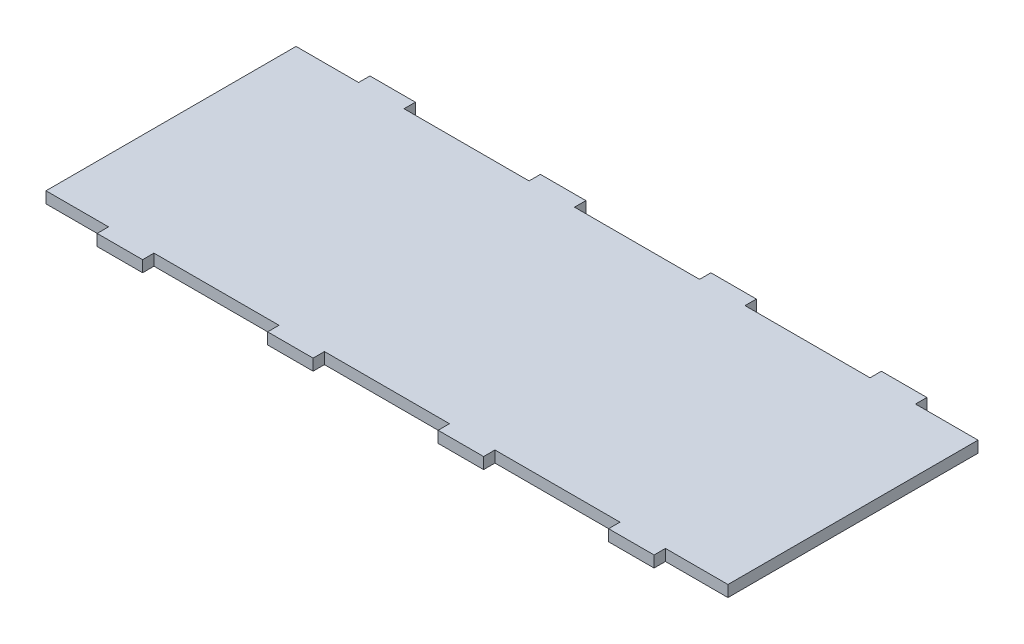
ISO-10303-21;
HEADER;
FILE_DESCRIPTION(('STEP AP214'),'2;1');
FILE_NAME('part.step','',(''),(''),'','','');
FILE_SCHEMA(('AUTOMOTIVE_DESIGN { 1 0 10303 214 1 1 1 1 }'));
ENDSEC;
DATA;
#1=APPLICATION_CONTEXT('core data for automotive mechanical design processes');
#2=APPLICATION_PROTOCOL_DEFINITION('international standard','automotive_design',2000,#1);
#3=PRODUCT_CONTEXT('',#1,'mechanical');
#4=PRODUCT('Part','Part','',(#3));
#5=PRODUCT_RELATED_PRODUCT_CATEGORY('part','',(#4));
#6=PRODUCT_DEFINITION_FORMATION('','',#4);
#7=PRODUCT_DEFINITION_CONTEXT('part definition',#1,'design');
#8=PRODUCT_DEFINITION('design','',#6,#7);
#9=PRODUCT_DEFINITION_SHAPE('','',#8);
#10=(LENGTH_UNIT() NAMED_UNIT(*) SI_UNIT(.MILLI.,.METRE.));
#11=(NAMED_UNIT(*) PLANE_ANGLE_UNIT() SI_UNIT($,.RADIAN.));
#12=(NAMED_UNIT(*) SI_UNIT($,.STERADIAN.) SOLID_ANGLE_UNIT());
#13=UNCERTAINTY_MEASURE_WITH_UNIT(LENGTH_MEASURE(1.E-05),#10,'distance_accuracy_value','');
#14=(GEOMETRIC_REPRESENTATION_CONTEXT(3) GLOBAL_UNCERTAINTY_ASSIGNED_CONTEXT((#13)) GLOBAL_UNIT_ASSIGNED_CONTEXT((#10,
#11,#12)) REPRESENTATION_CONTEXT('',''));
#15=CARTESIAN_POINT('',(0.,0.,0.));
#16=DIRECTION('',(0.,0.,1.));
#17=DIRECTION('',(1.,0.,0.));
#18=AXIS2_PLACEMENT_3D('',#15,#16,#17);
#19=CARTESIAN_POINT('',(190.5,6.35,-76.2));
#20=DIRECTION('',(-1.,0.,0.));
#21=DIRECTION('',(0.,0.,1.));
#22=AXIS2_PLACEMENT_3D('',#19,#20,#21);
#23=PLANE('',#22);
#24=DIRECTION('',(0.,-1.,0.));
#25=VECTOR('',#24,1.);
#26=CARTESIAN_POINT('',(190.5,6.35,-69.8500000000003));
#27=LINE('',#26,#25);
#28=CARTESIAN_POINT('',(190.5,6.35,-69.8500000000003));
#29=VERTEX_POINT('',#28);
#30=CARTESIAN_POINT('',(190.5,0.,-69.8500000000003));
#31=VERTEX_POINT('',#30);
#32=EDGE_CURVE('E449',#29,#31,#27,.T.);
#33=ORIENTED_EDGE('',*,*,#32,.F.);
#34=DIRECTION('',(0.,0.,-1.));
#35=VECTOR('',#34,1.);
#36=CARTESIAN_POINT('',(190.5,6.35,-76.2));
#37=LINE('',#36,#35);
#38=CARTESIAN_POINT('',(190.5,6.35,69.85));
#39=VERTEX_POINT('',#38);
#40=EDGE_CURVE('E333',#39,#29,#37,.T.);
#41=ORIENTED_EDGE('',*,*,#40,.F.);
#42=DIRECTION('',(0.,-1.,0.));
#43=VECTOR('',#42,1.);
#44=CARTESIAN_POINT('',(190.5,6.35,69.8500000000001));
#45=LINE('',#44,#43);
#46=CARTESIAN_POINT('',(190.5,0.,69.85));
#47=VERTEX_POINT('',#46);
#48=EDGE_CURVE('E364',#39,#47,#45,.T.);
#49=ORIENTED_EDGE('',*,*,#48,.T.);
#50=DIRECTION('',(0.,0.,-1.));
#51=VECTOR('',#50,1.);
#52=CARTESIAN_POINT('',(190.5,0.,-76.2));
#53=LINE('',#52,#51);
#54=EDGE_CURVE('E306',#47,#31,#53,.T.);
#55=ORIENTED_EDGE('',*,*,#54,.T.);
#56=EDGE_LOOP('',(#33,#41,#49,#55));
#57=FACE_BOUND('',#56,.T.);
#58=ADVANCED_FACE('F35',(#57),#23,.F.);
#59=CARTESIAN_POINT('',(-190.5,6.35,-76.2));
#60=DIRECTION('',(0.,0.,1.));
#61=DIRECTION('',(1.,0.,0.));
#62=AXIS2_PLACEMENT_3D('',#59,#60,#61);
#63=PLANE('',#62);
#64=DIRECTION('',(0.,1.,0.));
#65=VECTOR('',#64,1.);
#66=CARTESIAN_POINT('',(-155.575,0.,-76.2));
#67=LINE('',#66,#65);
#68=CARTESIAN_POINT('',(-155.575,0.,-76.2));
#69=VERTEX_POINT('',#68);
#70=CARTESIAN_POINT('',(-155.575,6.35,-76.2));
#71=VERTEX_POINT('',#70);
#72=EDGE_CURVE('E478',#69,#71,#67,.T.);
#73=ORIENTED_EDGE('',*,*,#72,.T.);
#74=DIRECTION('',(-1.,0.,0.));
#75=VECTOR('',#74,1.);
#76=CARTESIAN_POINT('',(-190.5,6.35,-76.2));
#77=LINE('',#76,#75);
#78=CARTESIAN_POINT('',(-130.175,6.35,-76.2));
#79=VERTEX_POINT('',#78);
#80=EDGE_CURVE('E329',#79,#71,#77,.T.);
#81=ORIENTED_EDGE('',*,*,#80,.F.);
#82=DIRECTION('',(0.,1.,0.));
#83=VECTOR('',#82,1.);
#84=CARTESIAN_POINT('',(-130.175,0.,-76.2));
#85=LINE('',#84,#83);
#86=CARTESIAN_POINT('',(-130.175,0.,-76.2));
#87=VERTEX_POINT('',#86);
#88=EDGE_CURVE('E495',#87,#79,#85,.T.);
#89=ORIENTED_EDGE('',*,*,#88,.F.);
#90=DIRECTION('',(-1.,0.,0.));
#91=VECTOR('',#90,1.);
#92=CARTESIAN_POINT('',(-190.5,0.,-76.2));
#93=LINE('',#92,#91);
#94=EDGE_CURVE('E299',#87,#69,#93,.T.);
#95=ORIENTED_EDGE('',*,*,#94,.T.);
#96=EDGE_LOOP('',(#73,#81,#89,#95));
#97=FACE_BOUND('',#96,.T.);
#98=ADVANCED_FACE('F573',(#97),#63,.F.);
#99=DIRECTION('',(0.,1.,0.));
#100=VECTOR('',#99,1.);
#101=CARTESIAN_POINT('',(-60.3249999999999,0.,-76.2));
#102=LINE('',#101,#100);
#103=CARTESIAN_POINT('',(-60.3249999999999,0.,-76.2));
#104=VERTEX_POINT('',#103);
#105=CARTESIAN_POINT('',(-60.3249999999999,6.35,-76.2));
#106=VERTEX_POINT('',#105);
#107=EDGE_CURVE('E492',#104,#106,#102,.T.);
#108=ORIENTED_EDGE('',*,*,#107,.T.);
#109=CARTESIAN_POINT('',(-34.9249999999999,6.35,-76.2));
#110=VERTEX_POINT('',#109);
#111=EDGE_CURVE('E332',#110,#106,#77,.T.);
#112=ORIENTED_EDGE('',*,*,#111,.F.);
#113=DIRECTION('',(0.,1.,0.));
#114=VECTOR('',#113,1.);
#115=CARTESIAN_POINT('',(-34.9249999999999,0.,-76.2));
#116=LINE('',#115,#114);
#117=CARTESIAN_POINT('',(-34.9249999999999,0.,-76.2));
#118=VERTEX_POINT('',#117);
#119=EDGE_CURVE('E455',#118,#110,#116,.T.);
#120=ORIENTED_EDGE('',*,*,#119,.F.);
#121=EDGE_CURVE('E303',#118,#104,#93,.T.);
#122=ORIENTED_EDGE('',*,*,#121,.T.);
#123=EDGE_LOOP('',(#108,#112,#120,#122));
#124=FACE_BOUND('',#123,.T.);
#125=ADVANCED_FACE('F562',(#124),#63,.F.);
#126=DIRECTION('',(0.,1.,0.));
#127=VECTOR('',#126,1.);
#128=CARTESIAN_POINT('',(155.575,0.,-76.2000000000003));
#129=LINE('',#128,#127);
#130=CARTESIAN_POINT('',(155.575,0.,-76.2000000000003));
#131=VERTEX_POINT('',#130);
#132=CARTESIAN_POINT('',(155.575,6.35,-76.2000000000003));
#133=VERTEX_POINT('',#132);
#134=EDGE_CURVE('E295',#131,#133,#129,.T.);
#135=ORIENTED_EDGE('',*,*,#134,.F.);
#136=CARTESIAN_POINT('',(130.175,0.,-76.2000000000001));
#137=VERTEX_POINT('',#136);
#138=EDGE_CURVE('E287',#131,#137,#93,.T.);
#139=ORIENTED_EDGE('',*,*,#138,.T.);
#140=DIRECTION('',(0.,1.,0.));
#141=VECTOR('',#140,1.);
#142=CARTESIAN_POINT('',(130.175,0.,-76.2000000000001));
#143=LINE('',#142,#141);
#144=CARTESIAN_POINT('',(130.175,6.35,-76.2000000000001));
#145=VERTEX_POINT('',#144);
#146=EDGE_CURVE('E266',#137,#145,#143,.T.);
#147=ORIENTED_EDGE('',*,*,#146,.T.);
#148=EDGE_CURVE('E328',#133,#145,#77,.T.);
#149=ORIENTED_EDGE('',*,*,#148,.F.);
#150=EDGE_LOOP('',(#135,#139,#147,#149));
#151=FACE_BOUND('',#150,.T.);
#152=ADVANCED_FACE('F294',(#151),#63,.F.);
#153=DIRECTION('',(0.,1.,0.));
#154=VECTOR('',#153,1.);
#155=CARTESIAN_POINT('',(60.3250000000001,0.,-76.2000000000001));
#156=LINE('',#155,#154);
#157=CARTESIAN_POINT('',(60.3250000000001,0.,-76.2000000000001));
#158=VERTEX_POINT('',#157);
#159=CARTESIAN_POINT('',(60.3250000000001,6.35,-76.2000000000001));
#160=VERTEX_POINT('',#159);
#161=EDGE_CURVE('E278',#158,#160,#156,.T.);
#162=ORIENTED_EDGE('',*,*,#161,.F.);
#163=CARTESIAN_POINT('',(34.9250000000001,0.,-76.2));
#164=VERTEX_POINT('',#163);
#165=EDGE_CURVE('E297',#158,#164,#93,.T.);
#166=ORIENTED_EDGE('',*,*,#165,.T.);
#167=DIRECTION('',(0.,1.,0.));
#168=VECTOR('',#167,1.);
#169=CARTESIAN_POINT('',(34.9250000000001,0.,-76.2));
#170=LINE('',#169,#168);
#171=CARTESIAN_POINT('',(34.9250000000001,6.35,-76.2));
#172=VERTEX_POINT('',#171);
#173=EDGE_CURVE('E452',#164,#172,#170,.T.);
#174=ORIENTED_EDGE('',*,*,#173,.T.);
#175=EDGE_CURVE('E546',#160,#172,#77,.T.);
#176=ORIENTED_EDGE('',*,*,#175,.F.);
#177=EDGE_LOOP('',(#162,#166,#174,#176));
#178=FACE_BOUND('',#177,.T.);
#179=ADVANCED_FACE('F544',(#178),#63,.F.);
#180=CARTESIAN_POINT('',(-190.5,6.35,-76.2));
#181=DIRECTION('',(1.,0.,0.));
#182=DIRECTION('',(0.,0.,-1.));
#183=AXIS2_PLACEMENT_3D('',#180,#181,#182);
#184=PLANE('',#183);
#185=DIRECTION('',(0.,1.,0.));
#186=VECTOR('',#185,1.);
#187=CARTESIAN_POINT('',(-190.5,6.35,-69.85));
#188=LINE('',#187,#186);
#189=CARTESIAN_POINT('',(-190.5,0.,-69.85));
#190=VERTEX_POINT('',#189);
#191=CARTESIAN_POINT('',(-190.5,6.35,-69.85));
#192=VERTEX_POINT('',#191);
#193=EDGE_CURVE('E406',#190,#192,#188,.T.);
#194=ORIENTED_EDGE('',*,*,#193,.F.);
#195=DIRECTION('',(0.,0.,1.));
#196=VECTOR('',#195,1.);
#197=CARTESIAN_POINT('',(-190.5,0.,-76.2));
#198=LINE('',#197,#196);
#199=CARTESIAN_POINT('',(-190.5,0.,69.85));
#200=VERTEX_POINT('',#199);
#201=EDGE_CURVE('E296',#190,#200,#198,.T.);
#202=ORIENTED_EDGE('',*,*,#201,.T.);
#203=DIRECTION('',(0.,1.,0.));
#204=VECTOR('',#203,1.);
#205=CARTESIAN_POINT('',(-190.5,6.35,69.85));
#206=LINE('',#205,#204);
#207=CARTESIAN_POINT('',(-190.5,6.35,69.85));
#208=VERTEX_POINT('',#207);
#209=EDGE_CURVE('E354',#200,#208,#206,.T.);
#210=ORIENTED_EDGE('',*,*,#209,.T.);
#211=DIRECTION('',(0.,0.,1.));
#212=VECTOR('',#211,1.);
#213=CARTESIAN_POINT('',(-190.5,6.35,-76.2));
#214=LINE('',#213,#212);
#215=EDGE_CURVE('E325',#192,#208,#214,.T.);
#216=ORIENTED_EDGE('',*,*,#215,.F.);
#217=EDGE_LOOP('',(#194,#202,#210,#216));
#218=FACE_BOUND('',#217,.T.);
#219=ADVANCED_FACE('F582',(#218),#184,.F.);
#220=CARTESIAN_POINT('',(0.,6.35,0.));
#221=DIRECTION('',(0.,1.,0.));
#222=DIRECTION('',(0.,0.,1.));
#223=AXIS2_PLACEMENT_3D('',#220,#221,#222);
#224=PLANE('',#223);
#225=ORIENTED_EDGE('',*,*,#80,.T.);
#226=DIRECTION('',(0.,0.,1.));
#227=VECTOR('',#226,1.);
#228=CARTESIAN_POINT('',(-155.575,6.35,-69.85));
#229=LINE('',#228,#227);
#230=CARTESIAN_POINT('',(-155.575,6.35,-69.85));
#231=VERTEX_POINT('',#230);
#232=EDGE_CURVE('E487',#71,#231,#229,.T.);
#233=ORIENTED_EDGE('',*,*,#232,.T.);
#234=DIRECTION('',(-1.,0.,0.));
#235=VECTOR('',#234,1.);
#236=CARTESIAN_POINT('',(-225.425,6.35,-69.85));
#237=LINE('',#236,#235);
#238=EDGE_CURVE('E483',#231,#192,#237,.T.);
#239=ORIENTED_EDGE('',*,*,#238,.T.);
#240=ORIENTED_EDGE('',*,*,#215,.T.);
#241=DIRECTION('',(-1.,0.,0.));
#242=VECTOR('',#241,1.);
#243=CARTESIAN_POINT('',(-225.425,6.35,69.85));
#244=LINE('',#243,#242);
#245=CARTESIAN_POINT('',(-155.575,6.35,69.85));
#246=VERTEX_POINT('',#245);
#247=EDGE_CURVE('E399',#246,#208,#244,.T.);
#248=ORIENTED_EDGE('',*,*,#247,.F.);
#249=DIRECTION('',(0.,0.,-1.));
#250=VECTOR('',#249,1.);
#251=CARTESIAN_POINT('',(-155.575,6.35,69.85));
#252=LINE('',#251,#250);
#253=CARTESIAN_POINT('',(-155.575,6.35,76.2));
#254=VERTEX_POINT('',#253);
#255=EDGE_CURVE('E403',#254,#246,#252,.T.);
#256=ORIENTED_EDGE('',*,*,#255,.F.);
#257=DIRECTION('',(1.,0.,0.));
#258=VECTOR('',#257,1.);
#259=CARTESIAN_POINT('',(-190.5,6.35,76.2));
#260=LINE('',#259,#258);
#261=CARTESIAN_POINT('',(-130.175,6.35,76.2));
#262=VERTEX_POINT('',#261);
#263=EDGE_CURVE('E323',#254,#262,#260,.T.);
#264=ORIENTED_EDGE('',*,*,#263,.T.);
#265=DIRECTION('',(0.,0.,1.));
#266=VECTOR('',#265,1.);
#267=CARTESIAN_POINT('',(-130.175,6.35,69.85));
#268=LINE('',#267,#266);
#269=CARTESIAN_POINT('',(-130.175,6.35,69.85));
#270=VERTEX_POINT('',#269);
#271=EDGE_CURVE('E422',#270,#262,#268,.T.);
#272=ORIENTED_EDGE('',*,*,#271,.F.);
#273=DIRECTION('',(-1.,0.,0.));
#274=VECTOR('',#273,1.);
#275=CARTESIAN_POINT('',(-130.175,6.35,69.85));
#276=LINE('',#275,#274);
#277=CARTESIAN_POINT('',(-60.3249999999999,6.35,69.85));
#278=VERTEX_POINT('',#277);
#279=EDGE_CURVE('E425',#278,#270,#276,.T.);
#280=ORIENTED_EDGE('',*,*,#279,.F.);
#281=DIRECTION('',(0.,0.,-1.));
#282=VECTOR('',#281,1.);
#283=CARTESIAN_POINT('',(-60.3249999999999,6.35,69.85));
#284=LINE('',#283,#282);
#285=CARTESIAN_POINT('',(-60.3249999999999,6.35,76.2));
#286=VERTEX_POINT('',#285);
#287=EDGE_CURVE('E398',#286,#278,#284,.T.);
#288=ORIENTED_EDGE('',*,*,#287,.F.);
#289=CARTESIAN_POINT('',(-34.9249999999999,6.35,76.2));
#290=VERTEX_POINT('',#289);
#291=EDGE_CURVE('E321',#286,#290,#260,.T.);
#292=ORIENTED_EDGE('',*,*,#291,.T.);
#293=DIRECTION('',(0.,0.,1.));
#294=VECTOR('',#293,1.);
#295=CARTESIAN_POINT('',(-34.9249999999999,6.35,69.85));
#296=LINE('',#295,#294);
#297=CARTESIAN_POINT('',(-34.9249999999999,6.35,69.85));
#298=VERTEX_POINT('',#297);
#299=EDGE_CURVE('E344',#298,#290,#296,.T.);
#300=ORIENTED_EDGE('',*,*,#299,.F.);
#301=DIRECTION('',(-1.,0.,0.));
#302=VECTOR('',#301,1.);
#303=CARTESIAN_POINT('',(-34.9249999999999,6.35,69.85));
#304=LINE('',#303,#302);
#305=CARTESIAN_POINT('',(34.9250000000001,6.35,69.85));
#306=VERTEX_POINT('',#305);
#307=EDGE_CURVE('E348',#306,#298,#304,.T.);
#308=ORIENTED_EDGE('',*,*,#307,.F.);
#309=DIRECTION('',(0.,0.,-1.));
#310=VECTOR('',#309,1.);
#311=CARTESIAN_POINT('',(34.9250000000001,6.35,69.85));
#312=LINE('',#311,#310);
#313=CARTESIAN_POINT('',(34.9250000000001,6.35,76.2));
#314=VERTEX_POINT('',#313);
#315=EDGE_CURVE('E351',#314,#306,#312,.T.);
#316=ORIENTED_EDGE('',*,*,#315,.F.);
#317=CARTESIAN_POINT('',(60.3250000000001,6.35,76.2));
#318=VERTEX_POINT('',#317);
#319=EDGE_CURVE('E324',#314,#318,#260,.T.);
#320=ORIENTED_EDGE('',*,*,#319,.T.);
#321=DIRECTION('',(0.,0.,1.));
#322=VECTOR('',#321,1.);
#323=CARTESIAN_POINT('',(60.3250000000001,6.35,69.85));
#324=LINE('',#323,#322);
#325=CARTESIAN_POINT('',(60.3250000000001,6.35,69.85));
#326=VERTEX_POINT('',#325);
#327=EDGE_CURVE('E376',#326,#318,#324,.T.);
#328=ORIENTED_EDGE('',*,*,#327,.F.);
#329=DIRECTION('',(-1.,0.,0.));
#330=VECTOR('',#329,1.);
#331=CARTESIAN_POINT('',(60.3250000000001,6.35,69.85));
#332=LINE('',#331,#330);
#333=CARTESIAN_POINT('',(130.175,6.35,69.85));
#334=VERTEX_POINT('',#333);
#335=EDGE_CURVE('E379',#334,#326,#332,.T.);
#336=ORIENTED_EDGE('',*,*,#335,.F.);
#337=DIRECTION('',(0.,0.,-1.));
#338=VECTOR('',#337,1.);
#339=CARTESIAN_POINT('',(130.175,6.35,69.85));
#340=LINE('',#339,#338);
#341=CARTESIAN_POINT('',(130.175,6.35,76.2));
#342=VERTEX_POINT('',#341);
#343=EDGE_CURVE('E382',#342,#334,#340,.T.);
#344=ORIENTED_EDGE('',*,*,#343,.F.);
#345=CARTESIAN_POINT('',(155.575,6.35,76.2));
#346=VERTEX_POINT('',#345);
#347=EDGE_CURVE('E327',#342,#346,#260,.T.);
#348=ORIENTED_EDGE('',*,*,#347,.T.);
#349=DIRECTION('',(0.,0.,1.));
#350=VECTOR('',#349,1.);
#351=CARTESIAN_POINT('',(155.575,6.35,69.8500000000001));
#352=LINE('',#351,#350);
#353=CARTESIAN_POINT('',(155.575,6.35,69.8500000000001));
#354=VERTEX_POINT('',#353);
#355=EDGE_CURVE('E443',#354,#346,#352,.T.);
#356=ORIENTED_EDGE('',*,*,#355,.F.);
#357=DIRECTION('',(-1.,0.,0.));
#358=VECTOR('',#357,1.);
#359=CARTESIAN_POINT('',(155.575,6.35,69.8500000000001));
#360=LINE('',#359,#358);
#361=EDGE_CURVE('E421',#39,#354,#360,.T.);
#362=ORIENTED_EDGE('',*,*,#361,.F.);
#363=ORIENTED_EDGE('',*,*,#40,.T.);
#364=DIRECTION('',(-1.,0.,0.));
#365=VECTOR('',#364,1.);
#366=CARTESIAN_POINT('',(155.575,6.35,-69.8500000000003));
#367=LINE('',#366,#365);
#368=CARTESIAN_POINT('',(155.575,6.35,-69.8500000000003));
#369=VERTEX_POINT('',#368);
#370=EDGE_CURVE('E520',#29,#369,#367,.T.);
#371=ORIENTED_EDGE('',*,*,#370,.T.);
#372=DIRECTION('',(0.,0.,-1.));
#373=VECTOR('',#372,1.);
#374=CARTESIAN_POINT('',(155.575,6.35,-69.8500000000003));
#375=LINE('',#374,#373);
#376=EDGE_CURVE('E502',#369,#133,#375,.T.);
#377=ORIENTED_EDGE('',*,*,#376,.T.);
#378=ORIENTED_EDGE('',*,*,#148,.T.);
#379=DIRECTION('',(0.,0.,1.));
#380=VECTOR('',#379,1.);
#381=CARTESIAN_POINT('',(130.175,6.35,-69.8500000000001));
#382=LINE('',#381,#380);
#383=CARTESIAN_POINT('',(130.175,6.35,-69.8500000000001));
#384=VERTEX_POINT('',#383);
#385=EDGE_CURVE('E273',#145,#384,#382,.T.);
#386=ORIENTED_EDGE('',*,*,#385,.T.);
#387=DIRECTION('',(-1.,0.,0.));
#388=VECTOR('',#387,1.);
#389=CARTESIAN_POINT('',(60.3250000000001,6.35,-69.8500000000002));
#390=LINE('',#389,#388);
#391=CARTESIAN_POINT('',(60.3250000000001,6.35,-69.8500000000002));
#392=VERTEX_POINT('',#391);
#393=EDGE_CURVE('E291',#384,#392,#390,.T.);
#394=ORIENTED_EDGE('',*,*,#393,.T.);
#395=DIRECTION('',(0.,0.,-1.));
#396=VECTOR('',#395,1.);
#397=CARTESIAN_POINT('',(60.3250000000001,6.35,-69.8500000000002));
#398=LINE('',#397,#396);
#399=EDGE_CURVE('E532',#392,#160,#398,.T.);
#400=ORIENTED_EDGE('',*,*,#399,.T.);
#401=ORIENTED_EDGE('',*,*,#175,.T.);
#402=DIRECTION('',(0.,0.,1.));
#403=VECTOR('',#402,1.);
#404=CARTESIAN_POINT('',(34.9250000000001,6.35,-69.85));
#405=LINE('',#404,#403);
#406=CARTESIAN_POINT('',(34.9250000000001,6.35,-69.85));
#407=VERTEX_POINT('',#406);
#408=EDGE_CURVE('E469',#172,#407,#405,.T.);
#409=ORIENTED_EDGE('',*,*,#408,.T.);
#410=DIRECTION('',(-1.,0.,0.));
#411=VECTOR('',#410,1.);
#412=CARTESIAN_POINT('',(-34.9249999999999,6.35,-69.85));
#413=LINE('',#412,#411);
#414=CARTESIAN_POINT('',(-34.9249999999999,6.35,-69.85));
#415=VERTEX_POINT('',#414);
#416=EDGE_CURVE('E462',#407,#415,#413,.T.);
#417=ORIENTED_EDGE('',*,*,#416,.T.);
#418=DIRECTION('',(0.,0.,-1.));
#419=VECTOR('',#418,1.);
#420=CARTESIAN_POINT('',(-34.9249999999999,6.35,-69.85));
#421=LINE('',#420,#419);
#422=EDGE_CURVE('E466',#415,#110,#421,.T.);
#423=ORIENTED_EDGE('',*,*,#422,.T.);
#424=ORIENTED_EDGE('',*,*,#111,.T.);
#425=DIRECTION('',(0.,0.,1.));
#426=VECTOR('',#425,1.);
#427=CARTESIAN_POINT('',(-60.3249999999999,6.35,-69.85));
#428=LINE('',#427,#426);
#429=CARTESIAN_POINT('',(-60.3249999999999,6.35,-69.85));
#430=VERTEX_POINT('',#429);
#431=EDGE_CURVE('E482',#106,#430,#428,.T.);
#432=ORIENTED_EDGE('',*,*,#431,.T.);
#433=DIRECTION('',(-1.,0.,0.));
#434=VECTOR('',#433,1.);
#435=CARTESIAN_POINT('',(-130.175,6.35,-69.85));
#436=LINE('',#435,#434);
#437=CARTESIAN_POINT('',(-130.175,6.35,-69.85));
#438=VERTEX_POINT('',#437);
#439=EDGE_CURVE('E503',#430,#438,#436,.T.);
#440=ORIENTED_EDGE('',*,*,#439,.T.);
#441=DIRECTION('',(0.,0.,-1.));
#442=VECTOR('',#441,1.);
#443=CARTESIAN_POINT('',(-130.175,6.35,-69.85));
#444=LINE('',#443,#442);
#445=EDGE_CURVE('E507',#438,#79,#444,.T.);
#446=ORIENTED_EDGE('',*,*,#445,.T.);
#447=EDGE_LOOP('',(#225,#233,#239,#240,#248,#256,#264,#272,#280,#288,#292,#300,#308,#316,#320,
#328,#336,#344,#348,#356,#362,#363,#371,#377,#378,#386,#394,#400,#401,#409,#417,#423,#424,#432,
#440,#446));
#448=FACE_BOUND('',#447,.T.);
#449=ADVANCED_FACE('F557',(#448),#224,.T.);
#450=CARTESIAN_POINT('',(0.,0.,0.));
#451=DIRECTION('',(0.,1.,0.));
#452=DIRECTION('',(0.,0.,1.));
#453=AXIS2_PLACEMENT_3D('',#450,#451,#452);
#454=PLANE('',#453);
#455=DIRECTION('',(0.,0.,1.));
#456=VECTOR('',#455,1.);
#457=CARTESIAN_POINT('',(-155.575,0.,-69.85));
#458=LINE('',#457,#456);
#459=CARTESIAN_POINT('',(-155.575,0.,-69.85));
#460=VERTEX_POINT('',#459);
#461=EDGE_CURVE('E486',#69,#460,#458,.T.);
#462=ORIENTED_EDGE('',*,*,#461,.F.);
#463=ORIENTED_EDGE('',*,*,#94,.F.);
#464=DIRECTION('',(0.,0.,-1.));
#465=VECTOR('',#464,1.);
#466=CARTESIAN_POINT('',(-130.175,0.,-69.85));
#467=LINE('',#466,#465);
#468=CARTESIAN_POINT('',(-130.175,0.,-69.85));
#469=VERTEX_POINT('',#468);
#470=EDGE_CURVE('E513',#469,#87,#467,.T.);
#471=ORIENTED_EDGE('',*,*,#470,.F.);
#472=DIRECTION('',(-1.,0.,0.));
#473=VECTOR('',#472,1.);
#474=CARTESIAN_POINT('',(-130.175,0.,-69.85));
#475=LINE('',#474,#473);
#476=CARTESIAN_POINT('',(-60.3249999999999,0.,-69.85));
#477=VERTEX_POINT('',#476);
#478=EDGE_CURVE('E496',#477,#469,#475,.T.);
#479=ORIENTED_EDGE('',*,*,#478,.F.);
#480=DIRECTION('',(0.,0.,1.));
#481=VECTOR('',#480,1.);
#482=CARTESIAN_POINT('',(-60.3249999999999,0.,-69.85));
#483=LINE('',#482,#481);
#484=EDGE_CURVE('E506',#104,#477,#483,.T.);
#485=ORIENTED_EDGE('',*,*,#484,.F.);
#486=ORIENTED_EDGE('',*,*,#121,.F.);
#487=DIRECTION('',(0.,0.,-1.));
#488=VECTOR('',#487,1.);
#489=CARTESIAN_POINT('',(-34.9249999999999,0.,-69.85));
#490=LINE('',#489,#488);
#491=CARTESIAN_POINT('',(-34.9249999999999,0.,-69.85));
#492=VERTEX_POINT('',#491);
#493=EDGE_CURVE('E475',#492,#118,#490,.T.);
#494=ORIENTED_EDGE('',*,*,#493,.F.);
#495=DIRECTION('',(-1.,0.,0.));
#496=VECTOR('',#495,1.);
#497=CARTESIAN_POINT('',(-34.9249999999999,0.,-69.85));
#498=LINE('',#497,#496);
#499=CARTESIAN_POINT('',(34.9250000000001,0.,-69.85));
#500=VERTEX_POINT('',#499);
#501=EDGE_CURVE('E456',#500,#492,#498,.T.);
#502=ORIENTED_EDGE('',*,*,#501,.F.);
#503=DIRECTION('',(0.,0.,1.));
#504=VECTOR('',#503,1.);
#505=CARTESIAN_POINT('',(34.9250000000001,0.,-69.85));
#506=LINE('',#505,#504);
#507=EDGE_CURVE('E465',#164,#500,#506,.T.);
#508=ORIENTED_EDGE('',*,*,#507,.F.);
#509=ORIENTED_EDGE('',*,*,#165,.F.);
#510=DIRECTION('',(0.,0.,-1.));
#511=VECTOR('',#510,1.);
#512=CARTESIAN_POINT('',(60.3250000000001,0.,-69.8500000000002));
#513=LINE('',#512,#511);
#514=CARTESIAN_POINT('',(60.3250000000001,0.,-69.8500000000002));
#515=VERTEX_POINT('',#514);
#516=EDGE_CURVE('E290',#515,#158,#513,.T.);
#517=ORIENTED_EDGE('',*,*,#516,.F.);
#518=DIRECTION('',(-1.,0.,0.));
#519=VECTOR('',#518,1.);
#520=CARTESIAN_POINT('',(60.3250000000001,0.,-69.8500000000002));
#521=LINE('',#520,#519);
#522=CARTESIAN_POINT('',(130.175,0.,-69.8500000000001));
#523=VERTEX_POINT('',#522);
#524=EDGE_CURVE('E279',#523,#515,#521,.T.);
#525=ORIENTED_EDGE('',*,*,#524,.F.);
#526=DIRECTION('',(0.,0.,1.));
#527=VECTOR('',#526,1.);
#528=CARTESIAN_POINT('',(130.175,0.,-69.8500000000001));
#529=LINE('',#528,#527);
#530=EDGE_CURVE('E270',#137,#523,#529,.T.);
#531=ORIENTED_EDGE('',*,*,#530,.F.);
#532=ORIENTED_EDGE('',*,*,#138,.F.);
#533=DIRECTION('',(0.,0.,-1.));
#534=VECTOR('',#533,1.);
#535=CARTESIAN_POINT('',(155.575,0.,-69.8500000000003));
#536=LINE('',#535,#534);
#537=CARTESIAN_POINT('',(155.575,0.,-69.8500000000003));
#538=VERTEX_POINT('',#537);
#539=EDGE_CURVE('E518',#538,#131,#536,.T.);
#540=ORIENTED_EDGE('',*,*,#539,.F.);
#541=DIRECTION('',(-1.,0.,0.));
#542=VECTOR('',#541,1.);
#543=CARTESIAN_POINT('',(0.,0.,-69.8500000000003));
#544=LINE('',#543,#542);
#545=EDGE_CURVE('E11',#31,#538,#544,.T.);
#546=ORIENTED_EDGE('',*,*,#545,.F.);
#547=ORIENTED_EDGE('',*,*,#54,.F.);
#548=DIRECTION('',(-1.,0.,0.));
#549=VECTOR('',#548,1.);
#550=CARTESIAN_POINT('',(0.,0.,69.8500000000001));
#551=LINE('',#550,#549);
#552=CARTESIAN_POINT('',(155.575,0.,69.8500000000001));
#553=VERTEX_POINT('',#552);
#554=EDGE_CURVE('E42',#47,#553,#551,.T.);
#555=ORIENTED_EDGE('',*,*,#554,.T.);
#556=DIRECTION('',(0.,0.,1.));
#557=VECTOR('',#556,1.);
#558=CARTESIAN_POINT('',(155.575,0.,69.8500000000001));
#559=LINE('',#558,#557);
#560=CARTESIAN_POINT('',(155.575,0.,76.2));
#561=VERTEX_POINT('',#560);
#562=EDGE_CURVE('E440',#553,#561,#559,.T.);
#563=ORIENTED_EDGE('',*,*,#562,.T.);
#564=DIRECTION('',(1.,0.,0.));
#565=VECTOR('',#564,1.);
#566=CARTESIAN_POINT('',(-190.5,0.,76.2));
#567=LINE('',#566,#565);
#568=CARTESIAN_POINT('',(130.175,0.,76.2));
#569=VERTEX_POINT('',#568);
#570=EDGE_CURVE('E300',#569,#561,#567,.T.);
#571=ORIENTED_EDGE('',*,*,#570,.F.);
#572=DIRECTION('',(0.,0.,-1.));
#573=VECTOR('',#572,1.);
#574=CARTESIAN_POINT('',(130.175,0.,69.85));
#575=LINE('',#574,#573);
#576=CARTESIAN_POINT('',(130.175,0.,69.85));
#577=VERTEX_POINT('',#576);
#578=EDGE_CURVE('E378',#569,#577,#575,.T.);
#579=ORIENTED_EDGE('',*,*,#578,.T.);
#580=DIRECTION('',(-1.,0.,0.));
#581=VECTOR('',#580,1.);
#582=CARTESIAN_POINT('',(60.3250000000001,0.,69.85));
#583=LINE('',#582,#581);
#584=CARTESIAN_POINT('',(60.3250000000001,0.,69.85));
#585=VERTEX_POINT('',#584);
#586=EDGE_CURVE('E388',#577,#585,#583,.T.);
#587=ORIENTED_EDGE('',*,*,#586,.T.);
#588=DIRECTION('',(0.,0.,1.));
#589=VECTOR('',#588,1.);
#590=CARTESIAN_POINT('',(60.3250000000001,0.,69.85));
#591=LINE('',#590,#589);
#592=CARTESIAN_POINT('',(60.3250000000001,0.,76.2));
#593=VERTEX_POINT('',#592);
#594=EDGE_CURVE('E370',#585,#593,#591,.T.);
#595=ORIENTED_EDGE('',*,*,#594,.T.);
#596=CARTESIAN_POINT('',(34.9250000000001,0.,76.2));
#597=VERTEX_POINT('',#596);
#598=EDGE_CURVE('E615',#597,#593,#567,.T.);
#599=ORIENTED_EDGE('',*,*,#598,.F.);
#600=DIRECTION('',(0.,0.,-1.));
#601=VECTOR('',#600,1.);
#602=CARTESIAN_POINT('',(34.9250000000001,0.,69.85));
#603=LINE('',#602,#601);
#604=CARTESIAN_POINT('',(34.9250000000001,0.,69.85));
#605=VERTEX_POINT('',#604);
#606=EDGE_CURVE('E347',#597,#605,#603,.T.);
#607=ORIENTED_EDGE('',*,*,#606,.T.);
#608=DIRECTION('',(-1.,0.,0.));
#609=VECTOR('',#608,1.);
#610=CARTESIAN_POINT('',(-34.9249999999999,0.,69.85));
#611=LINE('',#610,#609);
#612=CARTESIAN_POINT('',(-34.9249999999999,0.,69.85));
#613=VERTEX_POINT('',#612);
#614=EDGE_CURVE('E357',#605,#613,#611,.T.);
#615=ORIENTED_EDGE('',*,*,#614,.T.);
#616=DIRECTION('',(0.,0.,1.));
#617=VECTOR('',#616,1.);
#618=CARTESIAN_POINT('',(-34.9249999999999,0.,69.85));
#619=LINE('',#618,#617);
#620=CARTESIAN_POINT('',(-34.9249999999999,0.,76.2));
#621=VERTEX_POINT('',#620);
#622=EDGE_CURVE('E340',#613,#621,#619,.T.);
#623=ORIENTED_EDGE('',*,*,#622,.T.);
#624=CARTESIAN_POINT('',(-60.3249999999999,0.,76.2));
#625=VERTEX_POINT('',#624);
#626=EDGE_CURVE('E961',#625,#621,#567,.T.);
#627=ORIENTED_EDGE('',*,*,#626,.F.);
#628=DIRECTION('',(0.,0.,-1.));
#629=VECTOR('',#628,1.);
#630=CARTESIAN_POINT('',(-60.3249999999999,0.,69.85));
#631=LINE('',#630,#629);
#632=CARTESIAN_POINT('',(-60.3249999999999,0.,69.85));
#633=VERTEX_POINT('',#632);
#634=EDGE_CURVE('E424',#625,#633,#631,.T.);
#635=ORIENTED_EDGE('',*,*,#634,.T.);
#636=DIRECTION('',(-1.,0.,0.));
#637=VECTOR('',#636,1.);
#638=CARTESIAN_POINT('',(-130.175,0.,69.85));
#639=LINE('',#638,#637);
#640=CARTESIAN_POINT('',(-130.175,0.,69.85));
#641=VERTEX_POINT('',#640);
#642=EDGE_CURVE('E432',#633,#641,#639,.T.);
#643=ORIENTED_EDGE('',*,*,#642,.T.);
#644=DIRECTION('',(0.,0.,1.));
#645=VECTOR('',#644,1.);
#646=CARTESIAN_POINT('',(-130.175,0.,69.85));
#647=LINE('',#646,#645);
#648=CARTESIAN_POINT('',(-130.175,0.,76.2));
#649=VERTEX_POINT('',#648);
#650=EDGE_CURVE('E414',#641,#649,#647,.T.);
#651=ORIENTED_EDGE('',*,*,#650,.T.);
#652=CARTESIAN_POINT('',(-155.575,0.,76.2));
#653=VERTEX_POINT('',#652);
#654=EDGE_CURVE('E336',#653,#649,#567,.T.);
#655=ORIENTED_EDGE('',*,*,#654,.F.);
#656=DIRECTION('',(0.,0.,-1.));
#657=VECTOR('',#656,1.);
#658=CARTESIAN_POINT('',(-155.575,0.,69.85));
#659=LINE('',#658,#657);
#660=CARTESIAN_POINT('',(-155.575,0.,69.85));
#661=VERTEX_POINT('',#660);
#662=EDGE_CURVE('E402',#653,#661,#659,.T.);
#663=ORIENTED_EDGE('',*,*,#662,.T.);
#664=DIRECTION('',(-1.,0.,0.));
#665=VECTOR('',#664,1.);
#666=CARTESIAN_POINT('',(-225.425,0.,69.85));
#667=LINE('',#666,#665);
#668=EDGE_CURVE('E396',#661,#200,#667,.T.);
#669=ORIENTED_EDGE('',*,*,#668,.T.);
#670=ORIENTED_EDGE('',*,*,#201,.F.);
#671=DIRECTION('',(-1.,0.,0.));
#672=VECTOR('',#671,1.);
#673=CARTESIAN_POINT('',(-225.425,0.,-69.85));
#674=LINE('',#673,#672);
#675=EDGE_CURVE('E480',#460,#190,#674,.T.);
#676=ORIENTED_EDGE('',*,*,#675,.F.);
#677=EDGE_LOOP('',(#462,#463,#471,#479,#485,#486,#494,#502,#508,#509,#517,#525,#531,#532,#540,
#546,#547,#555,#563,#571,#579,#587,#595,#599,#607,#615,#623,#627,#635,#643,#651,#655,#663,#669,
#670,#676));
#678=FACE_BOUND('',#677,.T.);
#679=ADVANCED_FACE('F285',(#678),#454,.F.);
#680=CARTESIAN_POINT('',(-190.5,6.35,76.2));
#681=DIRECTION('',(0.,0.,-1.));
#682=DIRECTION('',(-1.,0.,0.));
#683=AXIS2_PLACEMENT_3D('',#680,#681,#682);
#684=PLANE('',#683);
#685=ORIENTED_EDGE('',*,*,#570,.T.);
#686=DIRECTION('',(0.,1.,0.));
#687=VECTOR('',#686,1.);
#688=CARTESIAN_POINT('',(155.575,0.,76.2));
#689=LINE('',#688,#687);
#690=EDGE_CURVE('E385',#561,#346,#689,.T.);
#691=ORIENTED_EDGE('',*,*,#690,.T.);
#692=ORIENTED_EDGE('',*,*,#347,.F.);
#693=DIRECTION('',(0.,1.,0.));
#694=VECTOR('',#693,1.);
#695=CARTESIAN_POINT('',(130.175,0.,76.2));
#696=LINE('',#695,#694);
#697=EDGE_CURVE('E366',#569,#342,#696,.T.);
#698=ORIENTED_EDGE('',*,*,#697,.F.);
#699=EDGE_LOOP('',(#685,#691,#692,#698));
#700=FACE_BOUND('',#699,.T.);
#701=ADVANCED_FACE('F627',(#700),#684,.F.);
#702=ORIENTED_EDGE('',*,*,#291,.F.);
#703=DIRECTION('',(0.,1.,0.));
#704=VECTOR('',#703,1.);
#705=CARTESIAN_POINT('',(-60.3249999999999,0.,76.2));
#706=LINE('',#705,#704);
#707=EDGE_CURVE('E419',#625,#286,#706,.T.);
#708=ORIENTED_EDGE('',*,*,#707,.F.);
#709=ORIENTED_EDGE('',*,*,#626,.T.);
#710=DIRECTION('',(0.,1.,0.));
#711=VECTOR('',#710,1.);
#712=CARTESIAN_POINT('',(-34.9249999999999,0.,76.2));
#713=LINE('',#712,#711);
#714=EDGE_CURVE('E318',#621,#290,#713,.T.);
#715=ORIENTED_EDGE('',*,*,#714,.T.);
#716=EDGE_LOOP('',(#702,#708,#709,#715));
#717=FACE_BOUND('',#716,.T.);
#718=ADVANCED_FACE('F789',(#717),#684,.F.);
#719=ORIENTED_EDGE('',*,*,#598,.T.);
#720=DIRECTION('',(0.,1.,0.));
#721=VECTOR('',#720,1.);
#722=CARTESIAN_POINT('',(60.3250000000001,0.,76.2));
#723=LINE('',#722,#721);
#724=EDGE_CURVE('E372',#593,#318,#723,.T.);
#725=ORIENTED_EDGE('',*,*,#724,.T.);
#726=ORIENTED_EDGE('',*,*,#319,.F.);
#727=DIRECTION('',(0.,1.,0.));
#728=VECTOR('',#727,1.);
#729=CARTESIAN_POINT('',(34.9250000000001,0.,76.2));
#730=LINE('',#729,#728);
#731=EDGE_CURVE('E313',#597,#314,#730,.T.);
#732=ORIENTED_EDGE('',*,*,#731,.F.);
#733=EDGE_LOOP('',(#719,#725,#726,#732));
#734=FACE_BOUND('',#733,.T.);
#735=ADVANCED_FACE('F613',(#734),#684,.F.);
#736=ORIENTED_EDGE('',*,*,#263,.F.);
#737=DIRECTION('',(0.,1.,0.));
#738=VECTOR('',#737,1.);
#739=CARTESIAN_POINT('',(-155.575,0.,76.2));
#740=LINE('',#739,#738);
#741=EDGE_CURVE('E395',#653,#254,#740,.T.);
#742=ORIENTED_EDGE('',*,*,#741,.F.);
#743=ORIENTED_EDGE('',*,*,#654,.T.);
#744=DIRECTION('',(0.,1.,0.));
#745=VECTOR('',#744,1.);
#746=CARTESIAN_POINT('',(-130.175,0.,76.2));
#747=LINE('',#746,#745);
#748=EDGE_CURVE('E416',#649,#262,#747,.T.);
#749=ORIENTED_EDGE('',*,*,#748,.T.);
#750=EDGE_LOOP('',(#736,#742,#743,#749));
#751=FACE_BOUND('',#750,.T.);
#752=ADVANCED_FACE('F596',(#751),#684,.F.);
#753=CARTESIAN_POINT('',(34.9250000000001,0.,69.85));
#754=DIRECTION('',(1.,0.,0.));
#755=DIRECTION('',(0.,0.,-1.));
#756=AXIS2_PLACEMENT_3D('',#753,#754,#755);
#757=PLANE('',#756);
#758=ORIENTED_EDGE('',*,*,#315,.T.);
#759=DIRECTION('',(0.,1.,0.));
#760=VECTOR('',#759,1.);
#761=CARTESIAN_POINT('',(34.9250000000001,0.,69.85));
#762=LINE('',#761,#760);
#763=EDGE_CURVE('E337',#605,#306,#762,.T.);
#764=ORIENTED_EDGE('',*,*,#763,.F.);
#765=ORIENTED_EDGE('',*,*,#606,.F.);
#766=ORIENTED_EDGE('',*,*,#731,.T.);
#767=EDGE_LOOP('',(#758,#764,#765,#766));
#768=FACE_BOUND('',#767,.T.);
#769=ADVANCED_FACE('F779',(#768),#757,.F.);
#770=CARTESIAN_POINT('',(-34.9249999999999,0.,69.85));
#771=DIRECTION('',(-1.,0.,0.));
#772=DIRECTION('',(0.,0.,1.));
#773=AXIS2_PLACEMENT_3D('',#770,#771,#772);
#774=PLANE('',#773);
#775=ORIENTED_EDGE('',*,*,#299,.T.);
#776=ORIENTED_EDGE('',*,*,#714,.F.);
#777=ORIENTED_EDGE('',*,*,#622,.F.);
#778=DIRECTION('',(0.,1.,0.));
#779=VECTOR('',#778,1.);
#780=CARTESIAN_POINT('',(-34.9249999999999,0.,69.85));
#781=LINE('',#780,#779);
#782=EDGE_CURVE('E339',#613,#298,#781,.T.);
#783=ORIENTED_EDGE('',*,*,#782,.T.);
#784=EDGE_LOOP('',(#775,#776,#777,#783));
#785=FACE_BOUND('',#784,.T.);
#786=ADVANCED_FACE('F812',(#785),#774,.F.);
#787=CARTESIAN_POINT('',(-34.9249999999999,0.,69.85));
#788=DIRECTION('',(0.,0.,-1.));
#789=DIRECTION('',(-1.,0.,0.));
#790=AXIS2_PLACEMENT_3D('',#787,#788,#789);
#791=PLANE('',#790);
#792=ORIENTED_EDGE('',*,*,#307,.T.);
#793=ORIENTED_EDGE('',*,*,#782,.F.);
#794=ORIENTED_EDGE('',*,*,#614,.F.);
#795=ORIENTED_EDGE('',*,*,#763,.T.);
#796=EDGE_LOOP('',(#792,#793,#794,#795));
#797=FACE_BOUND('',#796,.T.);
#798=ADVANCED_FACE('F768',(#797),#791,.F.);
#799=CARTESIAN_POINT('',(130.175,0.,69.85));
#800=DIRECTION('',(1.,0.,0.));
#801=DIRECTION('',(0.,0.,-1.));
#802=AXIS2_PLACEMENT_3D('',#799,#800,#801);
#803=PLANE('',#802);
#804=ORIENTED_EDGE('',*,*,#343,.T.);
#805=DIRECTION('',(0.,1.,0.));
#806=VECTOR('',#805,1.);
#807=CARTESIAN_POINT('',(130.175,0.,69.85));
#808=LINE('',#807,#806);
#809=EDGE_CURVE('E367',#577,#334,#808,.T.);
#810=ORIENTED_EDGE('',*,*,#809,.F.);
#811=ORIENTED_EDGE('',*,*,#578,.F.);
#812=ORIENTED_EDGE('',*,*,#697,.T.);
#813=EDGE_LOOP('',(#804,#810,#811,#812));
#814=FACE_BOUND('',#813,.T.);
#815=ADVANCED_FACE('F759',(#814),#803,.F.);
#816=CARTESIAN_POINT('',(60.3250000000001,0.,69.85));
#817=DIRECTION('',(-1.,0.,0.));
#818=DIRECTION('',(0.,0.,1.));
#819=AXIS2_PLACEMENT_3D('',#816,#817,#818);
#820=PLANE('',#819);
#821=ORIENTED_EDGE('',*,*,#327,.T.);
#822=ORIENTED_EDGE('',*,*,#724,.F.);
#823=ORIENTED_EDGE('',*,*,#594,.F.);
#824=DIRECTION('',(0.,1.,0.));
#825=VECTOR('',#824,1.);
#826=CARTESIAN_POINT('',(60.3250000000001,0.,69.85));
#827=LINE('',#826,#825);
#828=EDGE_CURVE('E369',#585,#326,#827,.T.);
#829=ORIENTED_EDGE('',*,*,#828,.T.);
#830=EDGE_LOOP('',(#821,#822,#823,#829));
#831=FACE_BOUND('',#830,.T.);
#832=ADVANCED_FACE('F617',(#831),#820,.F.);
#833=CARTESIAN_POINT('',(60.3250000000001,0.,69.85));
#834=DIRECTION('',(0.,0.,-1.));
#835=DIRECTION('',(-1.,0.,0.));
#836=AXIS2_PLACEMENT_3D('',#833,#834,#835);
#837=PLANE('',#836);
#838=ORIENTED_EDGE('',*,*,#335,.T.);
#839=ORIENTED_EDGE('',*,*,#828,.F.);
#840=ORIENTED_EDGE('',*,*,#586,.F.);
#841=ORIENTED_EDGE('',*,*,#809,.T.);
#842=EDGE_LOOP('',(#838,#839,#840,#841));
#843=FACE_BOUND('',#842,.T.);
#844=ADVANCED_FACE('F622',(#843),#837,.F.);
#845=CARTESIAN_POINT('',(155.575,0.,69.8500000000001));
#846=DIRECTION('',(0.,0.,-1.));
#847=DIRECTION('',(-1.,0.,0.));
#848=AXIS2_PLACEMENT_3D('',#845,#846,#847);
#849=PLANE('',#848);
#850=ORIENTED_EDGE('',*,*,#361,.T.);
#851=DIRECTION('',(0.,1.,0.));
#852=VECTOR('',#851,1.);
#853=CARTESIAN_POINT('',(155.575,0.,69.8500000000001));
#854=LINE('',#853,#852);
#855=EDGE_CURVE('E437',#553,#354,#854,.T.);
#856=ORIENTED_EDGE('',*,*,#855,.F.);
#857=ORIENTED_EDGE('',*,*,#554,.F.);
#858=ORIENTED_EDGE('',*,*,#48,.F.);
#859=EDGE_LOOP('',(#850,#856,#857,#858));
#860=FACE_BOUND('',#859,.T.);
#861=ADVANCED_FACE('F633',(#860),#849,.F.);
#862=CARTESIAN_POINT('',(155.575,0.,69.8500000000001));
#863=DIRECTION('',(-1.,0.,0.));
#864=DIRECTION('',(0.,0.,1.));
#865=AXIS2_PLACEMENT_3D('',#862,#863,#864);
#866=PLANE('',#865);
#867=ORIENTED_EDGE('',*,*,#355,.T.);
#868=ORIENTED_EDGE('',*,*,#690,.F.);
#869=ORIENTED_EDGE('',*,*,#562,.F.);
#870=ORIENTED_EDGE('',*,*,#855,.T.);
#871=EDGE_LOOP('',(#867,#868,#869,#870));
#872=FACE_BOUND('',#871,.T.);
#873=ADVANCED_FACE('F629',(#872),#866,.F.);
#874=CARTESIAN_POINT('',(-60.3249999999999,0.,69.85));
#875=DIRECTION('',(1.,0.,0.));
#876=DIRECTION('',(0.,0.,-1.));
#877=AXIS2_PLACEMENT_3D('',#874,#875,#876);
#878=PLANE('',#877);
#879=ORIENTED_EDGE('',*,*,#287,.T.);
#880=DIRECTION('',(0.,1.,0.));
#881=VECTOR('',#880,1.);
#882=CARTESIAN_POINT('',(-60.3249999999999,0.,69.85));
#883=LINE('',#882,#881);
#884=EDGE_CURVE('E411',#633,#278,#883,.T.);
#885=ORIENTED_EDGE('',*,*,#884,.F.);
#886=ORIENTED_EDGE('',*,*,#634,.F.);
#887=ORIENTED_EDGE('',*,*,#707,.T.);
#888=EDGE_LOOP('',(#879,#885,#886,#887));
#889=FACE_BOUND('',#888,.T.);
#890=ADVANCED_FACE('F716',(#889),#878,.F.);
#891=CARTESIAN_POINT('',(-130.175,0.,69.85));
#892=DIRECTION('',(-1.,0.,0.));
#893=DIRECTION('',(0.,0.,1.));
#894=AXIS2_PLACEMENT_3D('',#891,#892,#893);
#895=PLANE('',#894);
#896=ORIENTED_EDGE('',*,*,#271,.T.);
#897=ORIENTED_EDGE('',*,*,#748,.F.);
#898=ORIENTED_EDGE('',*,*,#650,.F.);
#899=DIRECTION('',(0.,1.,0.));
#900=VECTOR('',#899,1.);
#901=CARTESIAN_POINT('',(-130.175,0.,69.85));
#902=LINE('',#901,#900);
#903=EDGE_CURVE('E413',#641,#270,#902,.T.);
#904=ORIENTED_EDGE('',*,*,#903,.T.);
#905=EDGE_LOOP('',(#896,#897,#898,#904));
#906=FACE_BOUND('',#905,.T.);
#907=ADVANCED_FACE('F706',(#906),#895,.F.);
#908=CARTESIAN_POINT('',(-130.175,0.,69.85));
#909=DIRECTION('',(0.,0.,-1.));
#910=DIRECTION('',(-1.,0.,0.));
#911=AXIS2_PLACEMENT_3D('',#908,#909,#910);
#912=PLANE('',#911);
#913=ORIENTED_EDGE('',*,*,#279,.T.);
#914=ORIENTED_EDGE('',*,*,#903,.F.);
#915=ORIENTED_EDGE('',*,*,#642,.F.);
#916=ORIENTED_EDGE('',*,*,#884,.T.);
#917=EDGE_LOOP('',(#913,#914,#915,#916));
#918=FACE_BOUND('',#917,.T.);
#919=ADVANCED_FACE('F697',(#918),#912,.F.);
#920=CARTESIAN_POINT('',(-225.425,0.,69.85));
#921=DIRECTION('',(0.,0.,-1.));
#922=DIRECTION('',(-1.,0.,0.));
#923=AXIS2_PLACEMENT_3D('',#920,#921,#922);
#924=PLANE('',#923);
#925=ORIENTED_EDGE('',*,*,#668,.F.);
#926=DIRECTION('',(0.,1.,0.));
#927=VECTOR('',#926,1.);
#928=CARTESIAN_POINT('',(-155.575,0.,69.85));
#929=LINE('',#928,#927);
#930=EDGE_CURVE('E393',#661,#246,#929,.T.);
#931=ORIENTED_EDGE('',*,*,#930,.T.);
#932=ORIENTED_EDGE('',*,*,#247,.T.);
#933=ORIENTED_EDGE('',*,*,#209,.F.);
#934=EDGE_LOOP('',(#925,#931,#932,#933));
#935=FACE_BOUND('',#934,.T.);
#936=ADVANCED_FACE('F588',(#935),#924,.F.);
#937=CARTESIAN_POINT('',(-155.575,0.,69.85));
#938=DIRECTION('',(1.,0.,0.));
#939=DIRECTION('',(0.,0.,-1.));
#940=AXIS2_PLACEMENT_3D('',#937,#938,#939);
#941=PLANE('',#940);
#942=ORIENTED_EDGE('',*,*,#255,.T.);
#943=ORIENTED_EDGE('',*,*,#930,.F.);
#944=ORIENTED_EDGE('',*,*,#662,.F.);
#945=ORIENTED_EDGE('',*,*,#741,.T.);
#946=EDGE_LOOP('',(#942,#943,#944,#945));
#947=FACE_BOUND('',#946,.T.);
#948=ADVANCED_FACE('F590',(#947),#941,.F.);
#949=CARTESIAN_POINT('',(34.9250000000001,0.,-69.85));
#950=DIRECTION('',(-1.,0.,0.));
#951=DIRECTION('',(0.,0.,1.));
#952=AXIS2_PLACEMENT_3D('',#949,#950,#951);
#953=PLANE('',#952);
#954=ORIENTED_EDGE('',*,*,#408,.F.);
#955=ORIENTED_EDGE('',*,*,#173,.F.);
#956=ORIENTED_EDGE('',*,*,#507,.T.);
#957=DIRECTION('',(0.,1.,0.));
#958=VECTOR('',#957,1.);
#959=CARTESIAN_POINT('',(34.9250000000001,0.,-69.85));
#960=LINE('',#959,#958);
#961=EDGE_CURVE('E451',#500,#407,#960,.T.);
#962=ORIENTED_EDGE('',*,*,#961,.T.);
#963=EDGE_LOOP('',(#954,#955,#956,#962));
#964=FACE_BOUND('',#963,.T.);
#965=ADVANCED_FACE('F552',(#964),#953,.T.);
#966=CARTESIAN_POINT('',(-34.9249999999999,0.,-69.85));
#967=DIRECTION('',(0.,0.,-1.));
#968=DIRECTION('',(-1.,0.,0.));
#969=AXIS2_PLACEMENT_3D('',#966,#967,#968);
#970=PLANE('',#969);
#971=ORIENTED_EDGE('',*,*,#416,.F.);
#972=ORIENTED_EDGE('',*,*,#961,.F.);
#973=ORIENTED_EDGE('',*,*,#501,.T.);
#974=DIRECTION('',(0.,1.,0.));
#975=VECTOR('',#974,1.);
#976=CARTESIAN_POINT('',(-34.9249999999999,0.,-69.85));
#977=LINE('',#976,#975);
#978=EDGE_CURVE('E458',#492,#415,#977,.T.);
#979=ORIENTED_EDGE('',*,*,#978,.T.);
#980=EDGE_LOOP('',(#971,#972,#973,#979));
#981=FACE_BOUND('',#980,.T.);
#982=ADVANCED_FACE('F554',(#981),#970,.T.);
#983=CARTESIAN_POINT('',(-34.9249999999999,0.,-69.85));
#984=DIRECTION('',(1.,0.,0.));
#985=DIRECTION('',(0.,0.,-1.));
#986=AXIS2_PLACEMENT_3D('',#983,#984,#985);
#987=PLANE('',#986);
#988=ORIENTED_EDGE('',*,*,#422,.F.);
#989=ORIENTED_EDGE('',*,*,#978,.F.);
#990=ORIENTED_EDGE('',*,*,#493,.T.);
#991=ORIENTED_EDGE('',*,*,#119,.T.);
#992=EDGE_LOOP('',(#988,#989,#990,#991));
#993=FACE_BOUND('',#992,.T.);
#994=ADVANCED_FACE('F870',(#993),#987,.T.);
#995=CARTESIAN_POINT('',(130.175,0.,-69.8500000000001));
#996=DIRECTION('',(-1.,0.,0.));
#997=DIRECTION('',(0.,0.,1.));
#998=AXIS2_PLACEMENT_3D('',#995,#996,#997);
#999=PLANE('',#998);
#1000=ORIENTED_EDGE('',*,*,#385,.F.);
#1001=ORIENTED_EDGE('',*,*,#146,.F.);
#1002=ORIENTED_EDGE('',*,*,#530,.T.);
#1003=DIRECTION('',(0.,1.,0.));
#1004=VECTOR('',#1003,1.);
#1005=CARTESIAN_POINT('',(130.175,0.,-69.8500000000001));
#1006=LINE('',#1005,#1004);
#1007=EDGE_CURVE('E472',#523,#384,#1006,.T.);
#1008=ORIENTED_EDGE('',*,*,#1007,.T.);
#1009=EDGE_LOOP('',(#1000,#1001,#1002,#1008));
#1010=FACE_BOUND('',#1009,.T.);
#1011=ADVANCED_FACE('F268',(#1010),#999,.T.);
#1012=CARTESIAN_POINT('',(60.3250000000001,0.,-69.8500000000002));
#1013=DIRECTION('',(0.,0.,-1.));
#1014=DIRECTION('',(-1.,0.,0.));
#1015=AXIS2_PLACEMENT_3D('',#1012,#1013,#1014);
#1016=PLANE('',#1015);
#1017=ORIENTED_EDGE('',*,*,#393,.F.);
#1018=ORIENTED_EDGE('',*,*,#1007,.F.);
#1019=ORIENTED_EDGE('',*,*,#524,.T.);
#1020=DIRECTION('',(0.,1.,0.));
#1021=VECTOR('',#1020,1.);
#1022=CARTESIAN_POINT('',(60.3250000000001,0.,-69.8500000000002));
#1023=LINE('',#1022,#1021);
#1024=EDGE_CURVE('E527',#515,#392,#1023,.T.);
#1025=ORIENTED_EDGE('',*,*,#1024,.T.);
#1026=EDGE_LOOP('',(#1017,#1018,#1019,#1025));
#1027=FACE_BOUND('',#1026,.T.);
#1028=ADVANCED_FACE('F888',(#1027),#1016,.T.);
#1029=CARTESIAN_POINT('',(60.3250000000001,0.,-69.8500000000002));
#1030=DIRECTION('',(1.,0.,0.));
#1031=DIRECTION('',(0.,0.,-1.));
#1032=AXIS2_PLACEMENT_3D('',#1029,#1030,#1031);
#1033=PLANE('',#1032);
#1034=ORIENTED_EDGE('',*,*,#399,.F.);
#1035=ORIENTED_EDGE('',*,*,#1024,.F.);
#1036=ORIENTED_EDGE('',*,*,#516,.T.);
#1037=ORIENTED_EDGE('',*,*,#161,.T.);
#1038=EDGE_LOOP('',(#1034,#1035,#1036,#1037));
#1039=FACE_BOUND('',#1038,.T.);
#1040=ADVANCED_FACE('F540',(#1039),#1033,.T.);
#1041=CARTESIAN_POINT('',(155.575,0.,-69.8500000000003));
#1042=DIRECTION('',(0.,0.,-1.));
#1043=DIRECTION('',(-1.,0.,0.));
#1044=AXIS2_PLACEMENT_3D('',#1041,#1042,#1043);
#1045=PLANE('',#1044);
#1046=ORIENTED_EDGE('',*,*,#32,.T.);
#1047=ORIENTED_EDGE('',*,*,#545,.T.);
#1048=DIRECTION('',(0.,1.,0.));
#1049=VECTOR('',#1048,1.);
#1050=CARTESIAN_POINT('',(155.575,0.,-69.8500000000003));
#1051=LINE('',#1050,#1049);
#1052=EDGE_CURVE('E517',#538,#369,#1051,.T.);
#1053=ORIENTED_EDGE('',*,*,#1052,.T.);
#1054=ORIENTED_EDGE('',*,*,#370,.F.);
#1055=EDGE_LOOP('',(#1046,#1047,#1053,#1054));
#1056=FACE_BOUND('',#1055,.T.);
#1057=ADVANCED_FACE('F638',(#1056),#1045,.T.);
#1058=CARTESIAN_POINT('',(155.575,0.,-69.8500000000003));
#1059=DIRECTION('',(1.,0.,0.));
#1060=DIRECTION('',(0.,0.,-1.));
#1061=AXIS2_PLACEMENT_3D('',#1058,#1059,#1060);
#1062=PLANE('',#1061);
#1063=ORIENTED_EDGE('',*,*,#376,.F.);
#1064=ORIENTED_EDGE('',*,*,#1052,.F.);
#1065=ORIENTED_EDGE('',*,*,#539,.T.);
#1066=ORIENTED_EDGE('',*,*,#134,.T.);
#1067=EDGE_LOOP('',(#1063,#1064,#1065,#1066));
#1068=FACE_BOUND('',#1067,.T.);
#1069=ADVANCED_FACE('F640',(#1068),#1062,.T.);
#1070=CARTESIAN_POINT('',(-60.3249999999999,0.,-69.85));
#1071=DIRECTION('',(-1.,0.,0.));
#1072=DIRECTION('',(0.,0.,1.));
#1073=AXIS2_PLACEMENT_3D('',#1070,#1071,#1072);
#1074=PLANE('',#1073);
#1075=ORIENTED_EDGE('',*,*,#431,.F.);
#1076=ORIENTED_EDGE('',*,*,#107,.F.);
#1077=ORIENTED_EDGE('',*,*,#484,.T.);
#1078=DIRECTION('',(0.,1.,0.));
#1079=VECTOR('',#1078,1.);
#1080=CARTESIAN_POINT('',(-60.3249999999999,0.,-69.85));
#1081=LINE('',#1080,#1079);
#1082=EDGE_CURVE('E499',#477,#430,#1081,.T.);
#1083=ORIENTED_EDGE('',*,*,#1082,.T.);
#1084=EDGE_LOOP('',(#1075,#1076,#1077,#1083));
#1085=FACE_BOUND('',#1084,.T.);
#1086=ADVANCED_FACE('F566',(#1085),#1074,.T.);
#1087=CARTESIAN_POINT('',(-130.175,0.,-69.85));
#1088=DIRECTION('',(0.,0.,-1.));
#1089=DIRECTION('',(-1.,0.,0.));
#1090=AXIS2_PLACEMENT_3D('',#1087,#1088,#1089);
#1091=PLANE('',#1090);
#1092=ORIENTED_EDGE('',*,*,#439,.F.);
#1093=ORIENTED_EDGE('',*,*,#1082,.F.);
#1094=ORIENTED_EDGE('',*,*,#478,.T.);
#1095=DIRECTION('',(0.,1.,0.));
#1096=VECTOR('',#1095,1.);
#1097=CARTESIAN_POINT('',(-130.175,0.,-69.85));
#1098=LINE('',#1097,#1096);
#1099=EDGE_CURVE('E57',#469,#438,#1098,.T.);
#1100=ORIENTED_EDGE('',*,*,#1099,.T.);
#1101=EDGE_LOOP('',(#1092,#1093,#1094,#1100));
#1102=FACE_BOUND('',#1101,.T.);
#1103=ADVANCED_FACE('F571',(#1102),#1091,.T.);
#1104=CARTESIAN_POINT('',(-130.175,0.,-69.85));
#1105=DIRECTION('',(1.,0.,0.));
#1106=DIRECTION('',(0.,0.,-1.));
#1107=AXIS2_PLACEMENT_3D('',#1104,#1105,#1106);
#1108=PLANE('',#1107);
#1109=ORIENTED_EDGE('',*,*,#445,.F.);
#1110=ORIENTED_EDGE('',*,*,#1099,.F.);
#1111=ORIENTED_EDGE('',*,*,#470,.T.);
#1112=ORIENTED_EDGE('',*,*,#88,.T.);
#1113=EDGE_LOOP('',(#1109,#1110,#1111,#1112));
#1114=FACE_BOUND('',#1113,.T.);
#1115=ADVANCED_FACE('F930',(#1114),#1108,.T.);
#1116=CARTESIAN_POINT('',(-225.425,0.,-69.85));
#1117=DIRECTION('',(0.,0.,-1.));
#1118=DIRECTION('',(-1.,0.,0.));
#1119=AXIS2_PLACEMENT_3D('',#1116,#1117,#1118);
#1120=PLANE('',#1119);
#1121=ORIENTED_EDGE('',*,*,#193,.T.);
#1122=ORIENTED_EDGE('',*,*,#238,.F.);
#1123=DIRECTION('',(0.,1.,0.));
#1124=VECTOR('',#1123,1.);
#1125=CARTESIAN_POINT('',(-155.575,0.,-69.85));
#1126=LINE('',#1125,#1124);
#1127=EDGE_CURVE('E49',#460,#231,#1126,.T.);
#1128=ORIENTED_EDGE('',*,*,#1127,.F.);
#1129=ORIENTED_EDGE('',*,*,#675,.T.);
#1130=EDGE_LOOP('',(#1121,#1122,#1128,#1129));
#1131=FACE_BOUND('',#1130,.T.);
#1132=ADVANCED_FACE('F579',(#1131),#1120,.T.);
#1133=CARTESIAN_POINT('',(-155.575,0.,-69.85));
#1134=DIRECTION('',(-1.,0.,0.));
#1135=DIRECTION('',(0.,0.,1.));
#1136=AXIS2_PLACEMENT_3D('',#1133,#1134,#1135);
#1137=PLANE('',#1136);
#1138=ORIENTED_EDGE('',*,*,#232,.F.);
#1139=ORIENTED_EDGE('',*,*,#72,.F.);
#1140=ORIENTED_EDGE('',*,*,#461,.T.);
#1141=ORIENTED_EDGE('',*,*,#1127,.T.);
#1142=EDGE_LOOP('',(#1138,#1139,#1140,#1141));
#1143=FACE_BOUND('',#1142,.T.);
#1144=ADVANCED_FACE('F575',(#1143),#1137,.T.);
#1145=CLOSED_SHELL('',(#58,#98,#125,#152,#179,#219,#449,#679,#701,#718,#735,#752,#769,#786,#798,
#815,#832,#844,#861,#873,#890,#907,#919,#936,#948,#965,#982,#994,#1011,#1028,#1040,#1057,#1069,
#1086,#1103,#1115,#1132,#1144));
#1146=MANIFOLD_SOLID_BREP('B2',#1145);
#1147=ADVANCED_BREP_SHAPE_REPRESENTATION('',(#18,#1146),#14);
#1148=SHAPE_DEFINITION_REPRESENTATION(#9,#1147);
ENDSEC;
END-ISO-10303-21;
